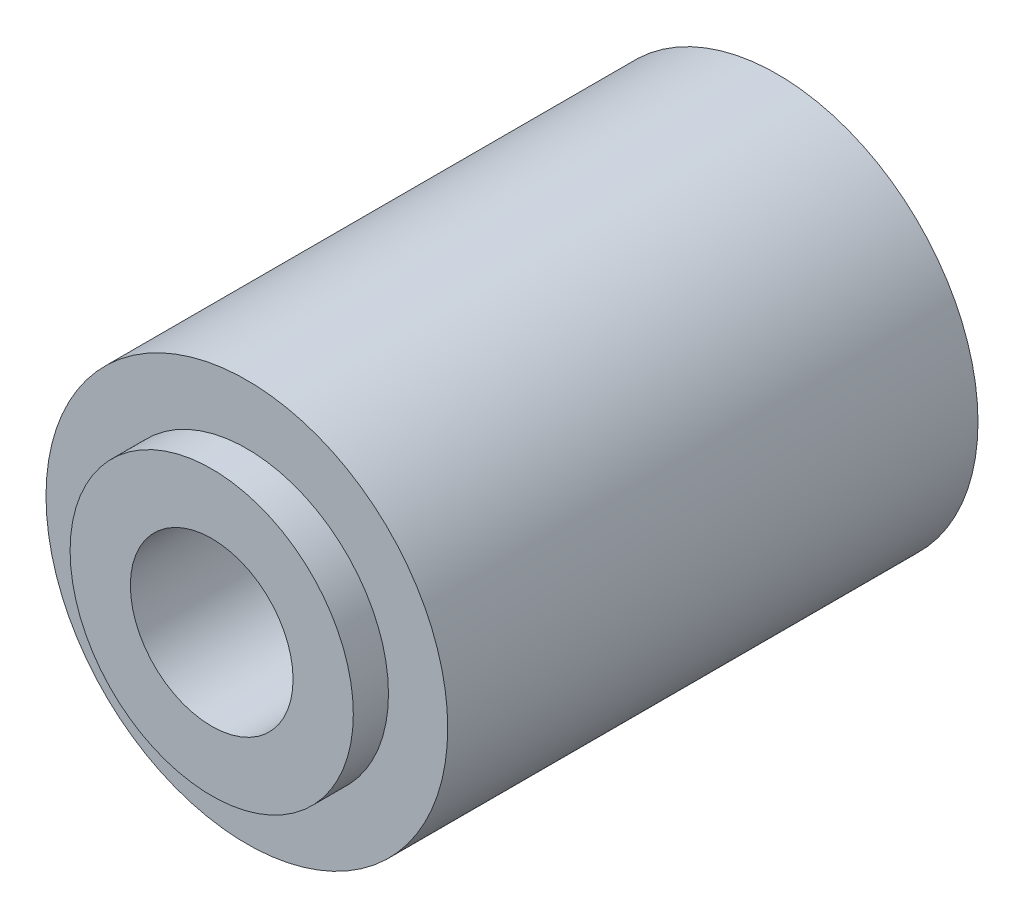
ISO-10303-21;
HEADER;
FILE_DESCRIPTION(('STEP AP214'),'2;1');
FILE_NAME('part.step','',(''),(''),'','','');
FILE_SCHEMA(('AUTOMOTIVE_DESIGN { 1 0 10303 214 1 1 1 1 }'));
ENDSEC;
DATA;
#1=APPLICATION_CONTEXT('core data for automotive mechanical design processes');
#2=APPLICATION_PROTOCOL_DEFINITION('international standard','automotive_design',2000,#1);
#3=PRODUCT_CONTEXT('',#1,'mechanical');
#4=PRODUCT('Part','Part','',(#3));
#5=PRODUCT_RELATED_PRODUCT_CATEGORY('part','',(#4));
#6=PRODUCT_DEFINITION_FORMATION('','',#4);
#7=PRODUCT_DEFINITION_CONTEXT('part definition',#1,'design');
#8=PRODUCT_DEFINITION('design','',#6,#7);
#9=PRODUCT_DEFINITION_SHAPE('','',#8);
#10=(LENGTH_UNIT() NAMED_UNIT(*) SI_UNIT(.MILLI.,.METRE.));
#11=(NAMED_UNIT(*) PLANE_ANGLE_UNIT() SI_UNIT($,.RADIAN.));
#12=(NAMED_UNIT(*) SI_UNIT($,.STERADIAN.) SOLID_ANGLE_UNIT());
#13=UNCERTAINTY_MEASURE_WITH_UNIT(LENGTH_MEASURE(1.E-05),#10,'distance_accuracy_value','');
#14=(GEOMETRIC_REPRESENTATION_CONTEXT(3) GLOBAL_UNCERTAINTY_ASSIGNED_CONTEXT((#13)) GLOBAL_UNIT_ASSIGNED_CONTEXT((#10,
#11,#12)) REPRESENTATION_CONTEXT('',''));
#15=CARTESIAN_POINT('',(0.,0.,0.));
#16=DIRECTION('',(0.,0.,1.));
#17=DIRECTION('',(1.,0.,0.));
#18=AXIS2_PLACEMENT_3D('',#15,#16,#17);
#19=CARTESIAN_POINT('',(0.,0.,0.));
#20=DIRECTION('',(0.,0.,1.));
#21=DIRECTION('',(1.,0.,0.));
#22=AXIS2_PLACEMENT_3D('',#19,#20,#21);
#23=PLANE('',#22);
#24=CARTESIAN_POINT('',(0.,0.,0.));
#25=DIRECTION('',(0.,0.,1.));
#26=DIRECTION('',(1.,0.,0.));
#27=AXIS2_PLACEMENT_3D('',#24,#25,#26);
#28=CIRCLE('',#27,10.);
#29=CARTESIAN_POINT('',(10.,0.,0.));
#30=VERTEX_POINT('',#29);
#31=EDGE_CURVE('E46',#30,#30,#28,.T.);
#32=ORIENTED_EDGE('',*,*,#31,.F.);
#33=EDGE_LOOP('',(#32));
#34=FACE_BOUND('',#33,.T.);
#35=CARTESIAN_POINT('',(0.,0.,0.));
#36=DIRECTION('',(0.,0.,1.));
#37=DIRECTION('',(1.,0.,0.));
#38=AXIS2_PLACEMENT_3D('',#35,#36,#37);
#39=CIRCLE('',#38,7.05);
#40=CARTESIAN_POINT('',(7.05,0.,0.));
#41=VERTEX_POINT('',#40);
#42=EDGE_CURVE('E10',#41,#41,#39,.F.);
#43=ORIENTED_EDGE('',*,*,#42,.F.);
#44=EDGE_LOOP('',(#43));
#45=FACE_BOUND('',#44,.T.);
#46=ADVANCED_FACE('F35',(#34,#45),#23,.F.);
#47=CARTESIAN_POINT('',(0.,0.,26.4));
#48=DIRECTION('',(0.,0.,1.));
#49=DIRECTION('',(1.,0.,0.));
#50=AXIS2_PLACEMENT_3D('',#47,#48,#49);
#51=PLANE('',#50);
#52=CARTESIAN_POINT('',(0.,0.,26.4));
#53=DIRECTION('',(0.,0.,1.));
#54=DIRECTION('',(1.,0.,0.));
#55=AXIS2_PLACEMENT_3D('',#52,#53,#54);
#56=CIRCLE('',#55,10.);
#57=CARTESIAN_POINT('',(10.,0.,26.4));
#58=VERTEX_POINT('',#57);
#59=EDGE_CURVE('E42',#58,#58,#56,.T.);
#60=ORIENTED_EDGE('',*,*,#59,.T.);
#61=EDGE_LOOP('',(#60));
#62=FACE_BOUND('',#61,.T.);
#63=CARTESIAN_POINT('',(0.,0.,26.4));
#64=DIRECTION('',(0.,0.,1.));
#65=DIRECTION('',(1.,0.,0.));
#66=AXIS2_PLACEMENT_3D('',#63,#64,#65);
#67=CIRCLE('',#66,7.05);
#68=CARTESIAN_POINT('',(7.05,0.,26.4));
#69=VERTEX_POINT('',#68);
#70=EDGE_CURVE('E53',#69,#69,#67,.T.);
#71=ORIENTED_EDGE('',*,*,#70,.F.);
#72=EDGE_LOOP('',(#71));
#73=FACE_BOUND('',#72,.T.);
#74=ADVANCED_FACE('F86',(#62,#73),#51,.T.);
#75=CARTESIAN_POINT('',(0.,0.,26.4));
#76=DIRECTION('',(0.,0.,-1.));
#77=DIRECTION('',(-1.,0.,0.));
#78=AXIS2_PLACEMENT_3D('',#75,#76,#77);
#79=CYLINDRICAL_SURFACE('',#78,10.);
#80=ORIENTED_EDGE('',*,*,#59,.F.);
#81=EDGE_LOOP('',(#80));
#82=FACE_BOUND('',#81,.T.);
#83=ORIENTED_EDGE('',*,*,#31,.T.);
#84=EDGE_LOOP('',(#83));
#85=FACE_BOUND('',#84,.T.);
#86=ADVANCED_FACE('F37',(#82,#85),#79,.T.);
#87=CARTESIAN_POINT('',(0.,0.,26.4));
#88=DIRECTION('',(0.,0.,-1.));
#89=DIRECTION('',(-1.,0.,0.));
#90=AXIS2_PLACEMENT_3D('',#87,#88,#89);
#91=CYLINDRICAL_SURFACE('',#90,4.05);
#92=CARTESIAN_POINT('',(0.,0.,28.15));
#93=DIRECTION('',(0.,0.,1.));
#94=DIRECTION('',(1.,0.,0.));
#95=AXIS2_PLACEMENT_3D('',#92,#93,#94);
#96=CIRCLE('',#95,4.05);
#97=CARTESIAN_POINT('',(4.05,0.,28.15));
#98=VERTEX_POINT('',#97);
#99=EDGE_CURVE('E56',#98,#98,#96,.T.);
#100=ORIENTED_EDGE('',*,*,#99,.T.);
#101=EDGE_LOOP('',(#100));
#102=FACE_BOUND('',#101,.T.);
#103=CARTESIAN_POINT('',(0.,0.,-1.75));
#104=DIRECTION('',(0.,0.,-1.));
#105=DIRECTION('',(-1.,0.,0.));
#106=AXIS2_PLACEMENT_3D('',#103,#104,#105);
#107=CIRCLE('',#106,4.05);
#108=CARTESIAN_POINT('',(-4.05,0.,-1.75));
#109=VERTEX_POINT('',#108);
#110=EDGE_CURVE('E64',#109,#109,#107,.T.);
#111=ORIENTED_EDGE('',*,*,#110,.T.);
#112=EDGE_LOOP('',(#111));
#113=FACE_BOUND('',#112,.T.);
#114=ADVANCED_FACE('F68',(#102,#113),#91,.F.);
#115=CARTESIAN_POINT('',(0.,0.,28.15));
#116=DIRECTION('',(0.,0.,1.));
#117=DIRECTION('',(1.,0.,0.));
#118=AXIS2_PLACEMENT_3D('',#115,#116,#117);
#119=PLANE('',#118);
#120=CARTESIAN_POINT('',(0.,0.,28.15));
#121=DIRECTION('',(0.,0.,1.));
#122=DIRECTION('',(1.,0.,0.));
#123=AXIS2_PLACEMENT_3D('',#120,#121,#122);
#124=CIRCLE('',#123,7.05);
#125=CARTESIAN_POINT('',(7.05,0.,28.15));
#126=VERTEX_POINT('',#125);
#127=EDGE_CURVE('E51',#126,#126,#124,.T.);
#128=ORIENTED_EDGE('',*,*,#127,.T.);
#129=EDGE_LOOP('',(#128));
#130=FACE_BOUND('',#129,.T.);
#131=ORIENTED_EDGE('',*,*,#99,.F.);
#132=EDGE_LOOP('',(#131));
#133=FACE_BOUND('',#132,.T.);
#134=ADVANCED_FACE('F82',(#130,#133),#119,.T.);
#135=CARTESIAN_POINT('',(0.,0.,28.15));
#136=DIRECTION('',(0.,0.,-1.));
#137=DIRECTION('',(-1.,0.,0.));
#138=AXIS2_PLACEMENT_3D('',#135,#136,#137);
#139=CYLINDRICAL_SURFACE('',#138,7.05);
#140=ORIENTED_EDGE('',*,*,#127,.F.);
#141=EDGE_LOOP('',(#140));
#142=FACE_BOUND('',#141,.T.);
#143=ORIENTED_EDGE('',*,*,#70,.T.);
#144=EDGE_LOOP('',(#143));
#145=FACE_BOUND('',#144,.T.);
#146=ADVANCED_FACE('F73',(#142,#145),#139,.T.);
#147=CARTESIAN_POINT('',(0.,0.,-1.75));
#148=DIRECTION('',(0.,0.,-1.));
#149=DIRECTION('',(-1.,0.,0.));
#150=AXIS2_PLACEMENT_3D('',#147,#148,#149);
#151=PLANE('',#150);
#152=CARTESIAN_POINT('',(0.,0.,-1.75));
#153=DIRECTION('',(0.,0.,-1.));
#154=DIRECTION('',(-1.,0.,0.));
#155=AXIS2_PLACEMENT_3D('',#152,#153,#154);
#156=CIRCLE('',#155,7.05);
#157=CARTESIAN_POINT('',(-7.05,0.,-1.75));
#158=VERTEX_POINT('',#157);
#159=EDGE_CURVE('E61',#158,#158,#156,.T.);
#160=ORIENTED_EDGE('',*,*,#159,.T.);
#161=EDGE_LOOP('',(#160));
#162=FACE_BOUND('',#161,.T.);
#163=ORIENTED_EDGE('',*,*,#110,.F.);
#164=EDGE_LOOP('',(#163));
#165=FACE_BOUND('',#164,.T.);
#166=ADVANCED_FACE('F70',(#162,#165),#151,.T.);
#167=CARTESIAN_POINT('',(0.,0.,-1.75));
#168=DIRECTION('',(0.,0.,1.));
#169=DIRECTION('',(1.,0.,0.));
#170=AXIS2_PLACEMENT_3D('',#167,#168,#169);
#171=CYLINDRICAL_SURFACE('',#170,7.05);
#172=ORIENTED_EDGE('',*,*,#159,.F.);
#173=EDGE_LOOP('',(#172));
#174=FACE_BOUND('',#173,.T.);
#175=ORIENTED_EDGE('',*,*,#42,.T.);
#176=EDGE_LOOP('',(#175));
#177=FACE_BOUND('',#176,.T.);
#178=ADVANCED_FACE('F72',(#174,#177),#171,.T.);
#179=CLOSED_SHELL('',(#46,#74,#86,#114,#134,#146,#166,#178));
#180=MANIFOLD_SOLID_BREP('B2',#179);
#181=ADVANCED_BREP_SHAPE_REPRESENTATION('',(#18,#180),#14);
#182=SHAPE_DEFINITION_REPRESENTATION(#9,#181);
ENDSEC;
END-ISO-10303-21;
